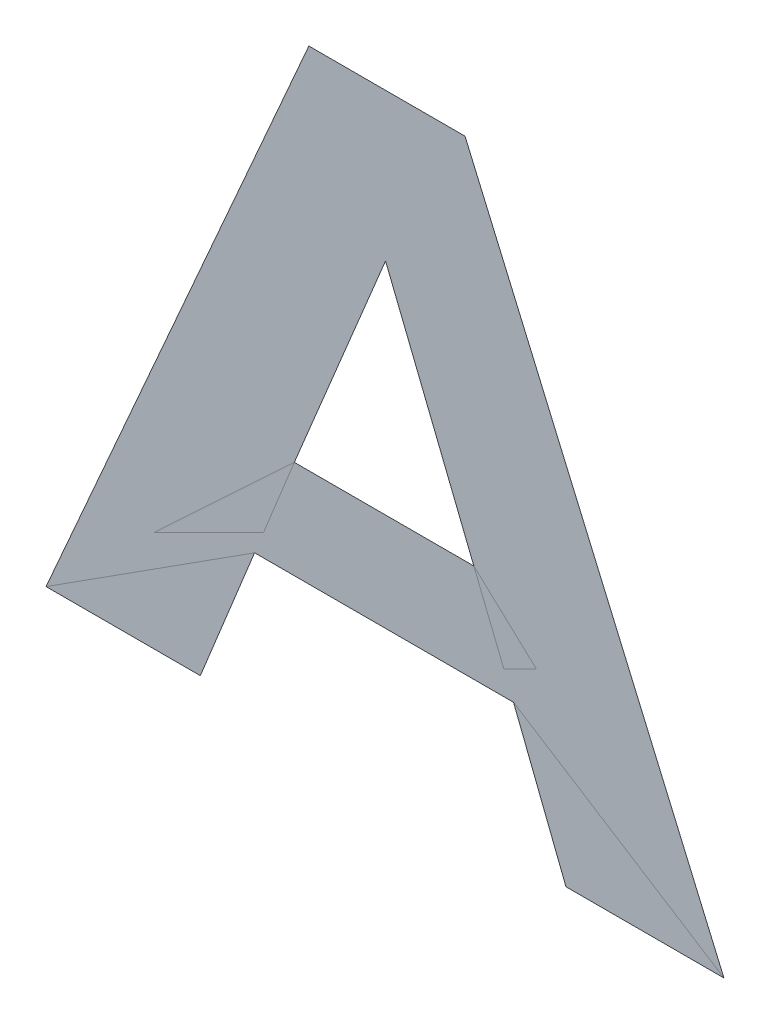
ISO-10303-21;
HEADER;
FILE_DESCRIPTION(('STEP AP214'),'2;1');
FILE_NAME('part.step','',(''),(''),'','','');
FILE_SCHEMA(('AUTOMOTIVE_DESIGN { 1 0 10303 214 1 1 1 1 }'));
ENDSEC;
DATA;
#1=APPLICATION_CONTEXT('core data for automotive mechanical design processes');
#2=APPLICATION_PROTOCOL_DEFINITION('international standard','automotive_design',2000,#1);
#3=PRODUCT_CONTEXT('',#1,'mechanical');
#4=PRODUCT('Part','Part','',(#3));
#5=PRODUCT_RELATED_PRODUCT_CATEGORY('part','',(#4));
#6=PRODUCT_DEFINITION_FORMATION('','',#4);
#7=PRODUCT_DEFINITION_CONTEXT('part definition',#1,'design');
#8=PRODUCT_DEFINITION('design','',#6,#7);
#9=PRODUCT_DEFINITION_SHAPE('','',#8);
#10=(LENGTH_UNIT() NAMED_UNIT(*) SI_UNIT(.MILLI.,.METRE.));
#11=(NAMED_UNIT(*) PLANE_ANGLE_UNIT() SI_UNIT($,.RADIAN.));
#12=(NAMED_UNIT(*) SI_UNIT($,.STERADIAN.) SOLID_ANGLE_UNIT());
#13=UNCERTAINTY_MEASURE_WITH_UNIT(LENGTH_MEASURE(1.E-05),#10,'distance_accuracy_value','');
#14=(GEOMETRIC_REPRESENTATION_CONTEXT(3) GLOBAL_UNCERTAINTY_ASSIGNED_CONTEXT((#13)) GLOBAL_UNIT_ASSIGNED_CONTEXT((#10,
#11,#12)) REPRESENTATION_CONTEXT('',''));
#15=CARTESIAN_POINT('',(0.,0.,0.));
#16=DIRECTION('',(0.,0.,1.));
#17=DIRECTION('',(1.,0.,0.));
#18=AXIS2_PLACEMENT_3D('',#15,#16,#17);
#19=CARTESIAN_POINT('',(-0.010557074999,0.899692190159,0.00015));
#20=DIRECTION('',(0.,0.,1.));
#21=DIRECTION('',(1.,0.,0.));
#22=AXIS2_PLACEMENT_3D('',#19,#20,#21);
#23=PLANE('',#22);
#24=CARTESIAN_POINT('',(-0.014528987299,0.909844441254,0.00015));
#25=DIRECTION('',(0.379670539490868,0.92512176573828,0.));
#26=VECTOR('',#25,1.);
#27=LINE('',#24,#26);
#28=CARTESIAN_POINT('',(-0.014528987299,0.909844441254,7.5E-05));
#29=VERTEX_POINT('',#28);
#30=CARTESIAN_POINT('',(-0.010533371507325,0.919481325502,7.5E-05));
#31=VERTEX_POINT('',#30);
#32=EDGE_CURVE('E80',#29,#31,#27,.T.);
#33=ORIENTED_EDGE('',*,*,#32,.T.);
#34=CARTESIAN_POINT('',(-0.01049273891565,0.919481325502,0.00015));
#35=DIRECTION('',(0.369024709506336,-0.929419584350236,0.));
#36=VECTOR('',#35,1.);
#37=LINE('',#34,#36);
#38=CARTESIAN_POINT('',(-0.00666642788235,0.909844441254,7.5E-05));
#39=VERTEX_POINT('',#38);
#40=EDGE_CURVE('E28',#31,#39,#37,.T.);
#41=ORIENTED_EDGE('',*,*,#40,.T.);
#42=CARTESIAN_POINT('',(-0.00666642788235,0.909844441254,0.00015));
#43=DIRECTION('',(-1.,0.,0.));
#44=VECTOR('',#43,1.);
#45=LINE('',#42,#44);
#46=EDGE_CURVE('E11',#39,#29,#45,.T.);
#47=ORIENTED_EDGE('',*,*,#46,.T.);
#48=EDGE_LOOP('',(#33,#41,#47));
#49=FACE_BOUND('',#48,.T.);
#50=CARTESIAN_POINT('',(-0.00263017738235,0.899692190159,0.00015));
#51=DIRECTION('',(1.,0.,0.));
#52=VECTOR('',#51,1.);
#53=LINE('',#50,#52);
#54=CARTESIAN_POINT('',(-0.00263017738235,0.899692190159,7.5E-05));
#55=VERTEX_POINT('',#54);
#56=CARTESIAN_POINT('',(0.004291041101,0.899692190159,7.5E-05));
#57=VERTEX_POINT('',#56);
#58=EDGE_CURVE('E171',#55,#57,#53,.T.);
#59=ORIENTED_EDGE('',*,*,#58,.T.);
#60=CARTESIAN_POINT('',(0.004291041101,0.899692190159,0.00015));
#61=DIRECTION('',(-0.396508989823609,0.918030838800669,0.));
#62=VECTOR('',#61,1.);
#63=LINE('',#60,#62);
#64=CARTESIAN_POINT('',(-0.00705244438235,0.92595557828,7.5E-05));
#65=VERTEX_POINT('',#64);
#66=EDGE_CURVE('E78',#57,#65,#63,.T.);
#67=ORIENTED_EDGE('',*,*,#66,.T.);
#68=CARTESIAN_POINT('',(-0.00705244438235001,0.92595557828,0.00015));
#69=DIRECTION('',(-1.,0.,0.));
#70=VECTOR('',#69,1.);
#71=LINE('',#68,#70);
#72=CARTESIAN_POINT('',(-0.01389239768235,0.92595557828,7.5E-05));
#73=VERTEX_POINT('',#72);
#74=EDGE_CURVE('E70',#65,#73,#71,.T.);
#75=ORIENTED_EDGE('',*,*,#74,.T.);
#76=CARTESIAN_POINT('',(-0.01389239768235,0.92595557828,0.00015));
#77=DIRECTION('',(-0.401479093127345,-0.915868187995218,0.));
#78=VECTOR('',#77,1.);
#79=LINE('',#76,#78);
#80=CARTESIAN_POINT('',(-0.025405191099,0.899692190159,7.5E-05));
#81=VERTEX_POINT('',#80);
#82=EDGE_CURVE('E66',#73,#81,#79,.T.);
#83=ORIENTED_EDGE('',*,*,#82,.T.);
#84=CARTESIAN_POINT('',(-0.025405191099,0.899692190159,0.00015));
#85=DIRECTION('',(1.,0.,0.));
#86=VECTOR('',#85,1.);
#87=LINE('',#84,#86);
#88=CARTESIAN_POINT('',(-0.01864650298235,0.899692190159,7.5E-05));
#89=VERTEX_POINT('',#88);
#90=EDGE_CURVE('E63',#81,#89,#87,.T.);
#91=ORIENTED_EDGE('',*,*,#90,.T.);
#92=CARTESIAN_POINT('',(-0.01864650298235,0.899692190159,0.00015));
#93=DIRECTION('',(0.376489203771603,0.926421005506365,0.));
#94=VECTOR('',#93,1.);
#95=LINE('',#92,#94);
#96=CARTESIAN_POINT('',(-0.01626945033235,0.90554136587,7.5E-05));
#97=VERTEX_POINT('',#96);
#98=EDGE_CURVE('E167',#89,#97,#95,.T.);
#99=ORIENTED_EDGE('',*,*,#98,.T.);
#100=CARTESIAN_POINT('',(-0.01626945033235,0.90554136587,0.00015));
#101=DIRECTION('',(1.,0.,0.));
#102=VECTOR('',#101,1.);
#103=LINE('',#100,#102);
#104=CARTESIAN_POINT('',(-0.004925964849,0.90554136587,7.5E-05));
#105=VERTEX_POINT('',#104);
#106=EDGE_CURVE('E168',#97,#105,#103,.T.);
#107=ORIENTED_EDGE('',*,*,#106,.T.);
#108=CARTESIAN_POINT('',(-0.004925964849,0.90554136587,0.00015));
#109=DIRECTION('',(0.365362422019413,-0.930865350400426,0.));
#110=VECTOR('',#109,1.);
#111=LINE('',#108,#110);
#112=EDGE_CURVE('E169',#105,#55,#111,.T.);
#113=ORIENTED_EDGE('',*,*,#112,.T.);
#114=EDGE_LOOP('',(#59,#67,#75,#83,#91,#99,#107,#113));
#115=FACE_BOUND('',#114,.T.);
#116=ADVANCED_FACE('F17',(#49,#115),#23,.T.);
#117=CARTESIAN_POINT('',(-0.010557074999,0.899692190159,0.));
#118=DIRECTION('',(0.,0.,1.));
#119=DIRECTION('',(1.,0.,0.));
#120=AXIS2_PLACEMENT_3D('',#117,#118,#119);
#121=PLANE('',#120);
#122=ORIENTED_EDGE('',*,*,#40,.F.);
#123=ORIENTED_EDGE('',*,*,#32,.F.);
#124=ORIENTED_EDGE('',*,*,#46,.F.);
#125=EDGE_LOOP('',(#122,#123,#124));
#126=FACE_BOUND('',#125,.T.);
#127=ORIENTED_EDGE('',*,*,#66,.F.);
#128=ORIENTED_EDGE('',*,*,#58,.F.);
#129=ORIENTED_EDGE('',*,*,#112,.F.);
#130=ORIENTED_EDGE('',*,*,#106,.F.);
#131=ORIENTED_EDGE('',*,*,#98,.F.);
#132=ORIENTED_EDGE('',*,*,#90,.F.);
#133=ORIENTED_EDGE('',*,*,#82,.F.);
#134=ORIENTED_EDGE('',*,*,#74,.F.);
#135=EDGE_LOOP('',(#127,#128,#129,#130,#131,#132,#133,#134));
#136=FACE_BOUND('',#135,.T.);
#137=ADVANCED_FACE('F69',(#126,#136),#121,.F.);
#138=CLOSED_SHELL('',(#116,#137));
#139=MANIFOLD_SOLID_BREP('B1',#138);
#140=ADVANCED_BREP_SHAPE_REPRESENTATION('',(#18,#139),#14);
#141=SHAPE_DEFINITION_REPRESENTATION(#9,#140);
ENDSEC;
END-ISO-10303-21;
